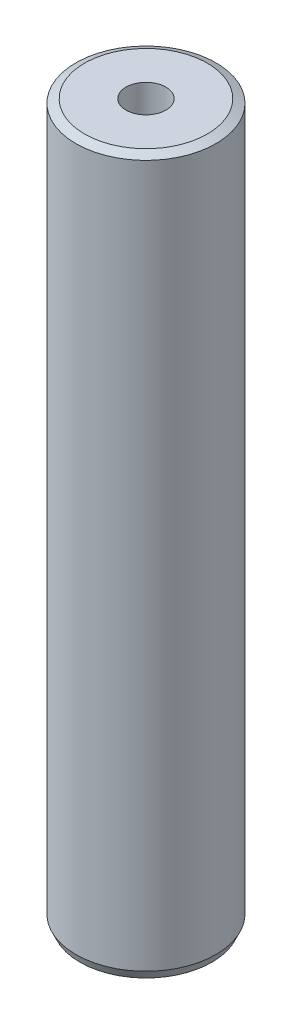
ISO-10303-21;
HEADER;
FILE_DESCRIPTION(('STEP AP214'),'2;1');
FILE_NAME('part.step','',(''),(''),'','','');
FILE_SCHEMA(('AUTOMOTIVE_DESIGN { 1 0 10303 214 1 1 1 1 }'));
ENDSEC;
DATA;
#1=APPLICATION_CONTEXT('core data for automotive mechanical design processes');
#2=APPLICATION_PROTOCOL_DEFINITION('international standard','automotive_design',2000,#1);
#3=PRODUCT_CONTEXT('',#1,'mechanical');
#4=PRODUCT('Part','Part','',(#3));
#5=PRODUCT_RELATED_PRODUCT_CATEGORY('part','',(#4));
#6=PRODUCT_DEFINITION_FORMATION('','',#4);
#7=PRODUCT_DEFINITION_CONTEXT('part definition',#1,'design');
#8=PRODUCT_DEFINITION('design','',#6,#7);
#9=PRODUCT_DEFINITION_SHAPE('','',#8);
#10=(LENGTH_UNIT() NAMED_UNIT(*) SI_UNIT(.MILLI.,.METRE.));
#11=(NAMED_UNIT(*) PLANE_ANGLE_UNIT() SI_UNIT($,.RADIAN.));
#12=(NAMED_UNIT(*) SI_UNIT($,.STERADIAN.) SOLID_ANGLE_UNIT());
#13=UNCERTAINTY_MEASURE_WITH_UNIT(LENGTH_MEASURE(1.E-05),#10,'distance_accuracy_value','');
#14=(GEOMETRIC_REPRESENTATION_CONTEXT(3) GLOBAL_UNCERTAINTY_ASSIGNED_CONTEXT((#13)) GLOBAL_UNIT_ASSIGNED_CONTEXT((#10,
#11,#12)) REPRESENTATION_CONTEXT('',''));
#15=CARTESIAN_POINT('',(0.,0.,0.));
#16=DIRECTION('',(0.,0.,1.));
#17=DIRECTION('',(1.,0.,0.));
#18=AXIS2_PLACEMENT_3D('',#15,#16,#17);
#19=CARTESIAN_POINT('',(0.,51.0239647502715,0.));
#20=DIRECTION('',(0.,-1.,0.));
#21=DIRECTION('',(0.,0.,-1.));
#22=AXIS2_PLACEMENT_3D('',#19,#20,#21);
#23=CYLINDRICAL_SURFACE('',#22,5.);
#24=CARTESIAN_POINT('',(0.,50.739265233343,0.));
#25=DIRECTION('',(0.,1.,0.));
#26=DIRECTION('',(0.,0.,1.));
#27=AXIS2_PLACEMENT_3D('',#24,#25,#26);
#28=CIRCLE('',#27,5.);
#29=CARTESIAN_POINT('',(0.,50.739265233343,5.));
#30=VERTEX_POINT('',#29);
#31=EDGE_CURVE('E50',#30,#30,#28,.F.);
#32=ORIENTED_EDGE('',*,*,#31,.T.);
#33=EDGE_LOOP('',(#32));
#34=FACE_BOUND('',#33,.T.);
#35=CARTESIAN_POINT('',(0.,0.6178553367105,0.));
#36=DIRECTION('',(0.,1.,0.));
#37=DIRECTION('',(0.,0.,1.));
#38=AXIS2_PLACEMENT_3D('',#35,#36,#37);
#39=CIRCLE('',#38,5.);
#40=CARTESIAN_POINT('',(0.,0.6178553367105,5.));
#41=VERTEX_POINT('',#40);
#42=EDGE_CURVE('E51',#41,#41,#39,.T.);
#43=ORIENTED_EDGE('',*,*,#42,.T.);
#44=EDGE_LOOP('',(#43));
#45=FACE_BOUND('',#44,.T.);
#46=ADVANCED_FACE('F39',(#34,#45),#23,.T.);
#47=CARTESIAN_POINT('',(0.,51.0239647502715,0.));
#48=DIRECTION('',(0.,1.,0.));
#49=DIRECTION('',(0.,0.,1.));
#50=AXIS2_PLACEMENT_3D('',#47,#48,#49);
#51=PLANE('',#50);
#52=CARTESIAN_POINT('',(0.,51.0239647502715,0.));
#53=DIRECTION('',(0.,1.,0.));
#54=DIRECTION('',(0.,0.,1.));
#55=AXIS2_PLACEMENT_3D('',#52,#53,#54);
#56=CIRCLE('',#55,4.3821446632895);
#57=CARTESIAN_POINT('',(0.,51.0239647502715,4.3821446632895));
#58=VERTEX_POINT('',#57);
#59=EDGE_CURVE('E54',#58,#58,#56,.T.);
#60=ORIENTED_EDGE('',*,*,#59,.T.);
#61=EDGE_LOOP('',(#60));
#62=FACE_BOUND('',#61,.T.);
#63=CARTESIAN_POINT('',(0.,51.0239647502715,0.));
#64=DIRECTION('',(0.,1.,0.));
#65=DIRECTION('',(0.,0.,1.));
#66=AXIS2_PLACEMENT_3D('',#63,#64,#65);
#67=CIRCLE('',#66,1.42532523233338);
#68=CARTESIAN_POINT('',(0.,51.0239647502715,1.42532523233338));
#69=VERTEX_POINT('',#68);
#70=EDGE_CURVE('E58',#69,#69,#67,.T.);
#71=ORIENTED_EDGE('',*,*,#70,.F.);
#72=EDGE_LOOP('',(#71));
#73=FACE_BOUND('',#72,.T.);
#74=ADVANCED_FACE('F69',(#62,#73),#51,.T.);
#75=CARTESIAN_POINT('',(0.,0.,0.));
#76=DIRECTION('',(0.,1.,0.));
#77=DIRECTION('',(0.,0.,1.));
#78=AXIS2_PLACEMENT_3D('',#75,#76,#77);
#79=PLANE('',#78);
#80=CARTESIAN_POINT('',(0.,0.,0.));
#81=DIRECTION('',(0.,1.,0.));
#82=DIRECTION('',(0.,0.,1.));
#83=AXIS2_PLACEMENT_3D('',#80,#81,#82);
#84=CIRCLE('',#83,4.71530048307148);
#85=CARTESIAN_POINT('',(0.,0.,4.71530048307148));
#86=VERTEX_POINT('',#85);
#87=EDGE_CURVE('E10',#86,#86,#84,.F.);
#88=ORIENTED_EDGE('',*,*,#87,.T.);
#89=EDGE_LOOP('',(#88));
#90=FACE_BOUND('',#89,.T.);
#91=CARTESIAN_POINT('',(0.,0.,0.));
#92=DIRECTION('',(0.,1.,0.));
#93=DIRECTION('',(0.,0.,1.));
#94=AXIS2_PLACEMENT_3D('',#91,#92,#93);
#95=CIRCLE('',#94,1.42532523233338);
#96=CARTESIAN_POINT('',(0.,0.,1.42532523233338));
#97=VERTEX_POINT('',#96);
#98=EDGE_CURVE('E63',#97,#97,#95,.T.);
#99=ORIENTED_EDGE('',*,*,#98,.T.);
#100=EDGE_LOOP('',(#99));
#101=FACE_BOUND('',#100,.T.);
#102=ADVANCED_FACE('F75',(#90,#101),#79,.F.);
#103=CARTESIAN_POINT('',(0.,51.0239647502715,0.));
#104=DIRECTION('',(0.,-1.,0.));
#105=DIRECTION('',(0.,0.,-1.));
#106=AXIS2_PLACEMENT_3D('',#103,#104,#105);
#107=CYLINDRICAL_SURFACE('',#106,1.42532523233338);
#108=ORIENTED_EDGE('',*,*,#70,.T.);
#109=EDGE_LOOP('',(#108));
#110=FACE_BOUND('',#109,.T.);
#111=ORIENTED_EDGE('',*,*,#98,.F.);
#112=EDGE_LOOP('',(#111));
#113=FACE_BOUND('',#112,.T.);
#114=ADVANCED_FACE('F70',(#110,#113),#107,.F.);
#115=CARTESIAN_POINT('',(0.,51.0239647502715,0.));
#116=DIRECTION('',(0.,-1.,0.));
#117=DIRECTION('',(0.,0.,-1.));
#118=AXIS2_PLACEMENT_3D('',#115,#116,#117);
#119=CONICAL_SURFACE('',#118,4.3821446632895,1.13900847968683);
#120=ORIENTED_EDGE('',*,*,#31,.F.);
#121=EDGE_LOOP('',(#120));
#122=FACE_BOUND('',#121,.T.);
#123=ORIENTED_EDGE('',*,*,#59,.F.);
#124=EDGE_LOOP('',(#123));
#125=FACE_BOUND('',#124,.T.);
#126=ADVANCED_FACE('F81',(#122,#125),#119,.T.);
#127=CARTESIAN_POINT('',(0.,0.6178553367105,0.));
#128=DIRECTION('',(0.,1.,0.));
#129=DIRECTION('',(0.,0.,1.));
#130=AXIS2_PLACEMENT_3D('',#127,#128,#129);
#131=CONICAL_SURFACE('',#130,5.,0.431787847108063);
#132=CARTESIAN_POINT('',(0.,0.,4.71530048307148));
#133=CARTESIAN_POINT('',(0.,0.00643599309073412,4.71826610303949));
#134=CARTESIAN_POINT('',(0.,0.0128719861814685,4.72123172300749));
#135=CARTESIAN_POINT('',(0.,0.0257439723629374,4.7271629629435));
#136=CARTESIAN_POINT('',(0.,0.0321799654536718,4.73012858291151));
#137=CARTESIAN_POINT('',(0.,0.0450519516351406,4.73605982284752));
#138=CARTESIAN_POINT('',(0.,0.0514879447258749,4.73902544281552));
#139=CARTESIAN_POINT('',(0.,0.0643599309073436,4.74495668275153));
#140=CARTESIAN_POINT('',(0.,0.070795923998078,4.74792230271954));
#141=CARTESIAN_POINT('',(0.,0.0836679101795468,4.75385354265555));
#142=CARTESIAN_POINT('',(0.,0.0901039032702812,4.75681916262356));
#143=CARTESIAN_POINT('',(0.,0.10297588945175,4.76275040255957));
#144=CARTESIAN_POINT('',(0.,0.109411882542484,4.76571602252757));
#145=CARTESIAN_POINT('',(0.,0.122283868723953,4.77164726246358));
#146=CARTESIAN_POINT('',(0.,0.128719861814687,4.77461288243159));
#147=CARTESIAN_POINT('',(0.,0.141591847996156,4.7805441223676));
#148=CARTESIAN_POINT('',(0.,0.14802784108689,4.7835097423356));
#149=CARTESIAN_POINT('',(0.,0.160899827268359,4.78944098227162));
#150=CARTESIAN_POINT('',(0.,0.167335820359094,4.79240660223962));
#151=CARTESIAN_POINT('',(0.,0.180207806540562,4.79833784217563));
#152=CARTESIAN_POINT('',(0.,0.186643799631297,4.80130346214364));
#153=CARTESIAN_POINT('',(0.,0.199515785812766,4.80723470207965));
#154=CARTESIAN_POINT('',(0.,0.2059517789035,4.81020032204765));
#155=CARTESIAN_POINT('',(0.,0.218823765084969,4.81613156198366));
#156=CARTESIAN_POINT('',(0.,0.225259758175703,4.81909718195167));
#157=CARTESIAN_POINT('',(0.,0.238131744357172,4.82502842188768));
#158=CARTESIAN_POINT('',(0.,0.244567737447906,4.82799404185569));
#159=CARTESIAN_POINT('',(0.,0.257439723629375,4.8339252817917));
#160=CARTESIAN_POINT('',(0.,0.263875716720109,4.8368909017597));
#161=CARTESIAN_POINT('',(0.,0.276747702901578,4.84282214169571));
#162=CARTESIAN_POINT('',(0.,0.283183695992312,4.84578776166372));
#163=CARTESIAN_POINT('',(0.,0.296055682173781,4.85171900159973));
#164=CARTESIAN_POINT('',(0.,0.302491675264516,4.85468462156773));
#165=CARTESIAN_POINT('',(0.,0.315363661445984,4.86061586150375));
#166=CARTESIAN_POINT('',(0.,0.321799654536719,4.86358148147175));
#167=CARTESIAN_POINT('',(0.,0.334671640718188,4.86951272140776));
#168=CARTESIAN_POINT('',(0.,0.341107633808922,4.87247834137577));
#169=CARTESIAN_POINT('',(0.,0.353979619990391,4.87840958131178));
#170=CARTESIAN_POINT('',(0.,0.360415613081125,4.88137520127978));
#171=CARTESIAN_POINT('',(0.,0.373287599262594,4.8873064412158));
#172=CARTESIAN_POINT('',(0.,0.379723592353328,4.8902720611838));
#173=CARTESIAN_POINT('',(0.,0.392595578534797,4.89620330111981));
#174=CARTESIAN_POINT('',(0.,0.399031571625531,4.89916892108782));
#175=CARTESIAN_POINT('',(0.,0.411903557807,4.90510016102383));
#176=CARTESIAN_POINT('',(0.,0.418339550897734,4.90806578099183));
#177=CARTESIAN_POINT('',(0.,0.431211537079203,4.91399702092784));
#178=CARTESIAN_POINT('',(0.,0.437647530169938,4.91696264089585));
#179=CARTESIAN_POINT('',(0.,0.450519516351406,4.92289388083186));
#180=CARTESIAN_POINT('',(0.,0.456955509442141,4.92585950079986));
#181=CARTESIAN_POINT('',(0.,0.469827495623609,4.93179074073588));
#182=CARTESIAN_POINT('',(0.,0.476263488714344,4.93475636070388));
#183=CARTESIAN_POINT('',(0.,0.489135474895813,4.94068760063989));
#184=CARTESIAN_POINT('',(0.,0.495571467986547,4.9436532206079));
#185=CARTESIAN_POINT('',(0.,0.508443454168016,4.94958446054391));
#186=CARTESIAN_POINT('',(0.,0.51487944725875,4.95255008051191));
#187=CARTESIAN_POINT('',(0.,0.527751433440219,4.95848132044792));
#188=CARTESIAN_POINT('',(0.,0.534187426530953,4.96144694041593));
#189=CARTESIAN_POINT('',(0.,0.547059412712422,4.96737818035194));
#190=CARTESIAN_POINT('',(0.,0.553495405803156,4.97034380031995));
#191=CARTESIAN_POINT('',(0.,0.566367391984625,4.97627504025596));
#192=CARTESIAN_POINT('',(0.,0.572803385075359,4.97924066022396));
#193=CARTESIAN_POINT('',(0.,0.585675371256828,4.98517190015997));
#194=CARTESIAN_POINT('',(0.,0.592111364347563,4.98813752012798));
#195=CARTESIAN_POINT('',(0.,0.604983350529032,4.99406876006399));
#196=CARTESIAN_POINT('',(0.,0.611419343619766,4.99703438003199));
#197=CARTESIAN_POINT('',(0.,0.6178553367105,5.));
#198=B_SPLINE_CURVE_WITH_KNOTS('',3,(#132,#133,#134,#135,#136,#137,#138,#139,#140,#141,#142,
#143,#144,#145,#146,#147,#148,#149,#150,#151,#152,#153,#154,#155,#156,#157,#158,#159,#160,#161,
#162,#163,#164,#165,#166,#167,#168,#169,#170,#171,#172,#173,#174,#175,#176,#177,#178,#179,#180,
#181,#182,#183,#184,#185,#186,#187,#188,#189,#190,#191,#192,#193,#194,#195,#196,#197),
.UNSPECIFIED.,.F.,.F.,(4,2,2,2,2,2,2,2,2,2,2,2,2,2,2,2,2,2,2,2,2,2,2,2,2,2,2,2,2,2,2,2,4),(0.,
0.0212591669575156,0.0425183339150308,0.0637775008725463,0.0850366678300619,0.106295834787577,
0.127555001745093,0.148814168702608,0.170073335660124,0.191332502617639,0.212591669575155,
0.23385083653267,0.255110003490186,0.276369170447701,0.297628337405217,0.318887504362732,
0.340146671320247,0.361405838277763,0.382665005235278,0.403924172192794,0.425183339150309,
0.446442506107825,0.46770167306534,0.488960840022856,0.510220006980371,0.531479173937887,
0.552738340895402,0.573997507852917,0.595256674810433,0.616515841767948,0.637775008725464,
0.659034175682979,0.680293342640495),.UNSPECIFIED.);
#199=EDGE_CURVE('BSEAM45',#86,#41,#198,.T.);
#200=ORIENTED_EDGE('',*,*,#87,.F.);
#201=ORIENTED_EDGE('',*,*,#42,.F.);
#202=ORIENTED_EDGE('',*,*,#199,.T.);
#203=ORIENTED_EDGE('',*,*,#199,.F.);
#204=EDGE_LOOP('',(#200,#202,#201,#203));
#205=FACE_BOUND('',#204,.T.);
#206=ADVANCED_FACE('F45',(#205),#131,.T.);
#207=CLOSED_SHELL('',(#46,#74,#102,#114,#126,#206));
#208=MANIFOLD_SOLID_BREP('B2',#207);
#209=ADVANCED_BREP_SHAPE_REPRESENTATION('',(#18,#208),#14);
#210=SHAPE_DEFINITION_REPRESENTATION(#9,#209);
ENDSEC;
END-ISO-10303-21;
